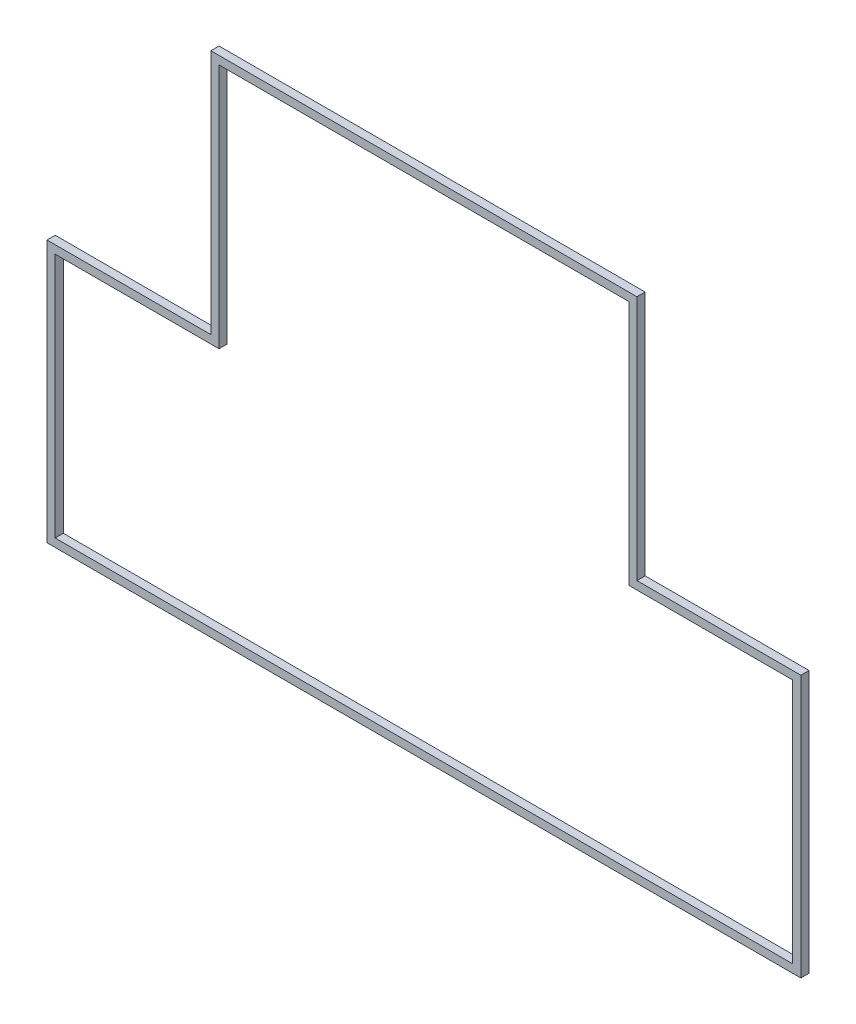
ISO-10303-21;
HEADER;
FILE_DESCRIPTION(('STEP AP214'),'2;1');
FILE_NAME('part.step','',(''),(''),'','','');
FILE_SCHEMA(('AUTOMOTIVE_DESIGN { 1 0 10303 214 1 1 1 1 }'));
ENDSEC;
DATA;
#1=APPLICATION_CONTEXT('core data for automotive mechanical design processes');
#2=APPLICATION_PROTOCOL_DEFINITION('international standard','automotive_design',2000,#1);
#3=PRODUCT_CONTEXT('',#1,'mechanical');
#4=PRODUCT('Part','Part','',(#3));
#5=PRODUCT_RELATED_PRODUCT_CATEGORY('part','',(#4));
#6=PRODUCT_DEFINITION_FORMATION('','',#4);
#7=PRODUCT_DEFINITION_CONTEXT('part definition',#1,'design');
#8=PRODUCT_DEFINITION('design','',#6,#7);
#9=PRODUCT_DEFINITION_SHAPE('','',#8);
#10=(LENGTH_UNIT() NAMED_UNIT(*) SI_UNIT(.MILLI.,.METRE.));
#11=(NAMED_UNIT(*) PLANE_ANGLE_UNIT() SI_UNIT($,.RADIAN.));
#12=(NAMED_UNIT(*) SI_UNIT($,.STERADIAN.) SOLID_ANGLE_UNIT());
#13=UNCERTAINTY_MEASURE_WITH_UNIT(LENGTH_MEASURE(1.E-05),#10,'distance_accuracy_value','');
#14=(GEOMETRIC_REPRESENTATION_CONTEXT(3) GLOBAL_UNCERTAINTY_ASSIGNED_CONTEXT((#13)) GLOBAL_UNIT_ASSIGNED_CONTEXT((#10,
#11,#12)) REPRESENTATION_CONTEXT('',''));
#15=CARTESIAN_POINT('',(0.,0.,0.));
#16=DIRECTION('',(0.,0.,1.));
#17=DIRECTION('',(1.,0.,0.));
#18=AXIS2_PLACEMENT_3D('',#15,#16,#17);
#19=CARTESIAN_POINT('',(143.917368028597,60.6995866341911,-39.1));
#20=DIRECTION('',(0.,0.,-1.));
#21=DIRECTION('',(-1.,0.,0.));
#22=AXIS2_PLACEMENT_3D('',#19,#20,#21);
#23=PLANE('',#22);
#24=DIRECTION('',(0.,1.,0.));
#25=VECTOR('',#24,1.);
#26=CARTESIAN_POINT('',(146.017368028597,63.5995866341911,-39.1));
#27=LINE('',#26,#25);
#28=CARTESIAN_POINT('',(146.017368028597,63.5995866341911,-39.1));
#29=VERTEX_POINT('',#28);
#30=CARTESIAN_POINT('',(146.017368028597,60.5995866341911,-39.1));
#31=VERTEX_POINT('',#30);
#32=EDGE_CURVE('E202',#29,#31,#27,.F.);
#33=ORIENTED_EDGE('',*,*,#32,.T.);
#34=DIRECTION('',(1.,0.,0.));
#35=VECTOR('',#34,1.);
#36=CARTESIAN_POINT('',(146.017368028597,60.5995866341911,-39.1));
#37=LINE('',#36,#35);
#38=CARTESIAN_POINT('',(144.017368028597,60.5995866341911,-39.1));
#39=VERTEX_POINT('',#38);
#40=EDGE_CURVE('E207',#31,#39,#37,.F.);
#41=ORIENTED_EDGE('',*,*,#40,.T.);
#42=DIRECTION('',(0.,1.,0.));
#43=VECTOR('',#42,1.);
#44=CARTESIAN_POINT('',(144.017368028597,60.5995866341911,-39.1));
#45=LINE('',#44,#43);
#46=CARTESIAN_POINT('',(144.017368028597,57.5995866341911,-39.1));
#47=VERTEX_POINT('',#46);
#48=EDGE_CURVE('E210',#39,#47,#45,.F.);
#49=ORIENTED_EDGE('',*,*,#48,.T.);
#50=DIRECTION('',(1.,0.,0.));
#51=VECTOR('',#50,1.);
#52=CARTESIAN_POINT('',(144.017368028597,57.5995866341911,-39.1));
#53=LINE('',#52,#51);
#54=CARTESIAN_POINT('',(153.017368028597,57.5995866341911,-39.1));
#55=VERTEX_POINT('',#54);
#56=EDGE_CURVE('E177',#47,#55,#53,.T.);
#57=ORIENTED_EDGE('',*,*,#56,.T.);
#58=DIRECTION('',(0.,1.,0.));
#59=VECTOR('',#58,1.);
#60=CARTESIAN_POINT('',(153.017368028597,57.5995866341911,-39.1));
#61=LINE('',#60,#59);
#62=CARTESIAN_POINT('',(153.017368028597,60.5995866341911,-39.1));
#63=VERTEX_POINT('',#62);
#64=EDGE_CURVE('E182',#55,#63,#61,.T.);
#65=ORIENTED_EDGE('',*,*,#64,.T.);
#66=DIRECTION('',(1.,0.,0.));
#67=VECTOR('',#66,1.);
#68=CARTESIAN_POINT('',(153.017368028597,60.5995866341911,-39.1));
#69=LINE('',#68,#67);
#70=CARTESIAN_POINT('',(151.017368028597,60.5995866341911,-39.1));
#71=VERTEX_POINT('',#70);
#72=EDGE_CURVE('E187',#63,#71,#69,.F.);
#73=ORIENTED_EDGE('',*,*,#72,.T.);
#74=DIRECTION('',(0.,1.,0.));
#75=VECTOR('',#74,1.);
#76=CARTESIAN_POINT('',(151.017368028597,60.5995866341911,-39.1));
#77=LINE('',#76,#75);
#78=CARTESIAN_POINT('',(151.017368028597,63.5995866341911,-39.1));
#79=VERTEX_POINT('',#78);
#80=EDGE_CURVE('E192',#71,#79,#77,.T.);
#81=ORIENTED_EDGE('',*,*,#80,.T.);
#82=DIRECTION('',(1.,0.,0.));
#83=VECTOR('',#82,1.);
#84=CARTESIAN_POINT('',(151.017368028597,63.5995866341911,-39.1));
#85=LINE('',#84,#83);
#86=EDGE_CURVE('E197',#79,#29,#85,.F.);
#87=ORIENTED_EDGE('',*,*,#86,.T.);
#88=EDGE_LOOP('',(#33,#41,#49,#57,#65,#73,#81,#87));
#89=FACE_BOUND('',#88,.T.);
#90=DIRECTION('',(0.,1.,0.));
#91=VECTOR('',#90,1.);
#92=CARTESIAN_POINT('',(153.117368028597,60.6995866341911,-39.1));
#93=LINE('',#92,#91);
#94=CARTESIAN_POINT('',(153.117368028597,60.6995866341911,-39.1));
#95=VERTEX_POINT('',#94);
#96=CARTESIAN_POINT('',(153.117368028597,57.4995866341911,-39.1));
#97=VERTEX_POINT('',#96);
#98=EDGE_CURVE('E164',#95,#97,#93,.F.);
#99=ORIENTED_EDGE('',*,*,#98,.T.);
#100=DIRECTION('',(1.,0.,0.));
#101=VECTOR('',#100,1.);
#102=CARTESIAN_POINT('',(153.117368028597,57.4995866341911,-39.1));
#103=LINE('',#102,#101);
#104=CARTESIAN_POINT('',(143.917368028597,57.4995866341911,-39.1));
#105=VERTEX_POINT('',#104);
#106=EDGE_CURVE('E169',#97,#105,#103,.F.);
#107=ORIENTED_EDGE('',*,*,#106,.T.);
#108=DIRECTION('',(0.,1.,0.));
#109=VECTOR('',#108,1.);
#110=CARTESIAN_POINT('',(143.917368028597,57.4995866341911,-39.1));
#111=LINE('',#110,#109);
#112=CARTESIAN_POINT('',(143.917368028597,60.6995866341911,-39.1));
#113=VERTEX_POINT('',#112);
#114=EDGE_CURVE('E131',#105,#113,#111,.T.);
#115=ORIENTED_EDGE('',*,*,#114,.T.);
#116=DIRECTION('',(1.,0.,0.));
#117=VECTOR('',#116,1.);
#118=CARTESIAN_POINT('',(143.917368028597,60.6995866341911,-39.1));
#119=LINE('',#118,#117);
#120=CARTESIAN_POINT('',(145.917368028597,60.6995866341911,-39.1));
#121=VERTEX_POINT('',#120);
#122=EDGE_CURVE('E20',#113,#121,#119,.T.);
#123=ORIENTED_EDGE('',*,*,#122,.T.);
#124=DIRECTION('',(0.,1.,0.));
#125=VECTOR('',#124,1.);
#126=CARTESIAN_POINT('',(145.917368028597,60.6995866341911,-39.1));
#127=LINE('',#126,#125);
#128=CARTESIAN_POINT('',(145.917368028597,63.6995866341911,-39.1));
#129=VERTEX_POINT('',#128);
#130=EDGE_CURVE('E127',#121,#129,#127,.T.);
#131=ORIENTED_EDGE('',*,*,#130,.T.);
#132=DIRECTION('',(1.,0.,0.));
#133=VECTOR('',#132,1.);
#134=CARTESIAN_POINT('',(145.917368028597,63.6995866341911,-39.1));
#135=LINE('',#134,#133);
#136=CARTESIAN_POINT('',(151.117368028597,63.6995866341911,-39.1));
#137=VERTEX_POINT('',#136);
#138=EDGE_CURVE('E149',#129,#137,#135,.T.);
#139=ORIENTED_EDGE('',*,*,#138,.T.);
#140=DIRECTION('',(0.,1.,0.));
#141=VECTOR('',#140,1.);
#142=CARTESIAN_POINT('',(151.117368028597,63.6995866341911,-39.1));
#143=LINE('',#142,#141);
#144=CARTESIAN_POINT('',(151.117368028597,60.6995866341911,-39.1));
#145=VERTEX_POINT('',#144);
#146=EDGE_CURVE('E154',#137,#145,#143,.F.);
#147=ORIENTED_EDGE('',*,*,#146,.T.);
#148=DIRECTION('',(1.,0.,0.));
#149=VECTOR('',#148,1.);
#150=CARTESIAN_POINT('',(151.117368028597,60.6995866341911,-39.1));
#151=LINE('',#150,#149);
#152=EDGE_CURVE('E159',#145,#95,#151,.T.);
#153=ORIENTED_EDGE('',*,*,#152,.T.);
#154=EDGE_LOOP('',(#99,#107,#115,#123,#131,#139,#147,#153));
#155=FACE_BOUND('',#154,.T.);
#156=ADVANCED_FACE('F17',(#89,#155),#23,.T.);
#157=CARTESIAN_POINT('',(143.917368028597,60.6995866341911,-39.1));
#158=DIRECTION('',(0.,-1.,0.));
#159=DIRECTION('',(0.,0.,-1.));
#160=AXIS2_PLACEMENT_3D('',#157,#158,#159);
#161=PLANE('',#160);
#162=DIRECTION('',(0.,0.,-1.));
#163=VECTOR('',#162,1.);
#164=CARTESIAN_POINT('',(145.917368028597,60.6995866341911,-39.1));
#165=LINE('',#164,#163);
#166=CARTESIAN_POINT('',(145.917368028597,60.6995866341911,-39.));
#167=VERTEX_POINT('',#166);
#168=EDGE_CURVE('E136',#167,#121,#165,.T.);
#169=ORIENTED_EDGE('',*,*,#168,.T.);
#170=ORIENTED_EDGE('',*,*,#122,.F.);
#171=DIRECTION('',(0.,0.,-1.));
#172=VECTOR('',#171,1.);
#173=CARTESIAN_POINT('',(143.917368028597,60.6995866341911,-39.1));
#174=LINE('',#173,#172);
#175=CARTESIAN_POINT('',(143.917368028597,60.6995866341911,-39.));
#176=VERTEX_POINT('',#175);
#177=EDGE_CURVE('E175',#113,#176,#174,.F.);
#178=ORIENTED_EDGE('',*,*,#177,.T.);
#179=DIRECTION('',(-1.,0.,0.));
#180=VECTOR('',#179,1.);
#181=CARTESIAN_POINT('',(143.917368028597,60.6995866341911,-39.));
#182=LINE('',#181,#180);
#183=EDGE_CURVE('E146',#176,#167,#182,.F.);
#184=ORIENTED_EDGE('',*,*,#183,.T.);
#185=EDGE_LOOP('',(#169,#170,#178,#184));
#186=FACE_BOUND('',#185,.T.);
#187=ADVANCED_FACE('F145',(#186),#161,.F.);
#188=CARTESIAN_POINT('',(145.917368028597,60.6995866341911,-39.1));
#189=DIRECTION('',(1.,0.,0.));
#190=DIRECTION('',(0.,0.,-1.));
#191=AXIS2_PLACEMENT_3D('',#188,#189,#190);
#192=PLANE('',#191);
#193=DIRECTION('',(0.,0.,-1.));
#194=VECTOR('',#193,1.);
#195=CARTESIAN_POINT('',(145.917368028597,63.6995866341911,-39.1));
#196=LINE('',#195,#194);
#197=CARTESIAN_POINT('',(145.917368028597,63.6995866341911,-39.));
#198=VERTEX_POINT('',#197);
#199=EDGE_CURVE('E142',#198,#129,#196,.T.);
#200=ORIENTED_EDGE('',*,*,#199,.T.);
#201=ORIENTED_EDGE('',*,*,#130,.F.);
#202=ORIENTED_EDGE('',*,*,#168,.F.);
#203=DIRECTION('',(0.,1.,0.));
#204=VECTOR('',#203,1.);
#205=CARTESIAN_POINT('',(145.917368028597,60.6995866341911,-39.));
#206=LINE('',#205,#204);
#207=EDGE_CURVE('E217',#167,#198,#206,.T.);
#208=ORIENTED_EDGE('',*,*,#207,.T.);
#209=EDGE_LOOP('',(#200,#201,#202,#208));
#210=FACE_BOUND('',#209,.T.);
#211=ADVANCED_FACE('F139',(#210),#192,.F.);
#212=CARTESIAN_POINT('',(145.917368028597,63.6995866341911,-39.1));
#213=DIRECTION('',(0.,-1.,0.));
#214=DIRECTION('',(0.,0.,-1.));
#215=AXIS2_PLACEMENT_3D('',#212,#213,#214);
#216=PLANE('',#215);
#217=DIRECTION('',(0.,0.,1.));
#218=VECTOR('',#217,1.);
#219=CARTESIAN_POINT('',(151.117368028597,63.6995866341911,-39.1));
#220=LINE('',#219,#218);
#221=CARTESIAN_POINT('',(151.117368028597,63.6995866341911,-39.));
#222=VERTEX_POINT('',#221);
#223=EDGE_CURVE('E151',#222,#137,#220,.F.);
#224=ORIENTED_EDGE('',*,*,#223,.T.);
#225=ORIENTED_EDGE('',*,*,#138,.F.);
#226=ORIENTED_EDGE('',*,*,#199,.F.);
#227=DIRECTION('',(-1.,0.,0.));
#228=VECTOR('',#227,1.);
#229=CARTESIAN_POINT('',(143.917368028597,63.6995866341911,-39.));
#230=LINE('',#229,#228);
#231=EDGE_CURVE('E219',#198,#222,#230,.F.);
#232=ORIENTED_EDGE('',*,*,#231,.T.);
#233=EDGE_LOOP('',(#224,#225,#226,#232));
#234=FACE_BOUND('',#233,.T.);
#235=ADVANCED_FACE('F328',(#234),#216,.F.);
#236=CARTESIAN_POINT('',(151.117368028597,63.6995866341911,-39.1));
#237=DIRECTION('',(-1.,0.,0.));
#238=DIRECTION('',(0.,0.,1.));
#239=AXIS2_PLACEMENT_3D('',#236,#237,#238);
#240=PLANE('',#239);
#241=DIRECTION('',(0.,0.,-1.));
#242=VECTOR('',#241,1.);
#243=CARTESIAN_POINT('',(151.117368028597,60.6995866341911,-39.1));
#244=LINE('',#243,#242);
#245=CARTESIAN_POINT('',(151.117368028597,60.6995866341911,-39.));
#246=VERTEX_POINT('',#245);
#247=EDGE_CURVE('E156',#246,#145,#244,.T.);
#248=ORIENTED_EDGE('',*,*,#247,.T.);
#249=ORIENTED_EDGE('',*,*,#146,.F.);
#250=ORIENTED_EDGE('',*,*,#223,.F.);
#251=DIRECTION('',(0.,1.,0.));
#252=VECTOR('',#251,1.);
#253=CARTESIAN_POINT('',(151.117368028597,60.6995866341911,-39.));
#254=LINE('',#253,#252);
#255=EDGE_CURVE('E222',#222,#246,#254,.F.);
#256=ORIENTED_EDGE('',*,*,#255,.T.);
#257=EDGE_LOOP('',(#248,#249,#250,#256));
#258=FACE_BOUND('',#257,.T.);
#259=ADVANCED_FACE('F324',(#258),#240,.F.);
#260=CARTESIAN_POINT('',(151.117368028597,60.6995866341911,-39.1));
#261=DIRECTION('',(0.,-1.,0.));
#262=DIRECTION('',(0.,0.,-1.));
#263=AXIS2_PLACEMENT_3D('',#260,#261,#262);
#264=PLANE('',#263);
#265=DIRECTION('',(0.,0.,1.));
#266=VECTOR('',#265,1.);
#267=CARTESIAN_POINT('',(153.117368028597,60.6995866341911,-39.1));
#268=LINE('',#267,#266);
#269=CARTESIAN_POINT('',(153.117368028597,60.6995866341911,-39.));
#270=VERTEX_POINT('',#269);
#271=EDGE_CURVE('E161',#270,#95,#268,.F.);
#272=ORIENTED_EDGE('',*,*,#271,.T.);
#273=ORIENTED_EDGE('',*,*,#152,.F.);
#274=ORIENTED_EDGE('',*,*,#247,.F.);
#275=DIRECTION('',(-1.,0.,0.));
#276=VECTOR('',#275,1.);
#277=CARTESIAN_POINT('',(143.917368028597,60.6995866341911,-39.));
#278=LINE('',#277,#276);
#279=EDGE_CURVE('E225',#246,#270,#278,.F.);
#280=ORIENTED_EDGE('',*,*,#279,.T.);
#281=EDGE_LOOP('',(#272,#273,#274,#280));
#282=FACE_BOUND('',#281,.T.);
#283=ADVANCED_FACE('F320',(#282),#264,.F.);
#284=CARTESIAN_POINT('',(153.117368028597,60.6995866341911,-39.1));
#285=DIRECTION('',(-1.,0.,0.));
#286=DIRECTION('',(0.,0.,1.));
#287=AXIS2_PLACEMENT_3D('',#284,#285,#286);
#288=PLANE('',#287);
#289=DIRECTION('',(0.,0.,1.));
#290=VECTOR('',#289,1.);
#291=CARTESIAN_POINT('',(153.117368028597,57.4995866341911,-39.1));
#292=LINE('',#291,#290);
#293=CARTESIAN_POINT('',(153.117368028597,57.4995866341911,-39.));
#294=VERTEX_POINT('',#293);
#295=EDGE_CURVE('E166',#294,#97,#292,.F.);
#296=ORIENTED_EDGE('',*,*,#295,.T.);
#297=ORIENTED_EDGE('',*,*,#98,.F.);
#298=ORIENTED_EDGE('',*,*,#271,.F.);
#299=DIRECTION('',(0.,1.,0.));
#300=VECTOR('',#299,1.);
#301=CARTESIAN_POINT('',(153.117368028597,60.6995866341911,-39.));
#302=LINE('',#301,#300);
#303=EDGE_CURVE('E228',#270,#294,#302,.F.);
#304=ORIENTED_EDGE('',*,*,#303,.T.);
#305=EDGE_LOOP('',(#296,#297,#298,#304));
#306=FACE_BOUND('',#305,.T.);
#307=ADVANCED_FACE('F316',(#306),#288,.F.);
#308=CARTESIAN_POINT('',(153.117368028597,57.4995866341911,-39.1));
#309=DIRECTION('',(0.,1.,0.));
#310=DIRECTION('',(0.,0.,1.));
#311=AXIS2_PLACEMENT_3D('',#308,#309,#310);
#312=PLANE('',#311);
#313=DIRECTION('',(0.,0.,-1.));
#314=VECTOR('',#313,1.);
#315=CARTESIAN_POINT('',(143.917368028597,57.4995866341911,-39.1));
#316=LINE('',#315,#314);
#317=CARTESIAN_POINT('',(143.917368028597,57.4995866341911,-39.));
#318=VERTEX_POINT('',#317);
#319=EDGE_CURVE('E171',#318,#105,#316,.T.);
#320=ORIENTED_EDGE('',*,*,#319,.T.);
#321=ORIENTED_EDGE('',*,*,#106,.F.);
#322=ORIENTED_EDGE('',*,*,#295,.F.);
#323=DIRECTION('',(-1.,0.,0.));
#324=VECTOR('',#323,1.);
#325=CARTESIAN_POINT('',(143.917368028597,57.4995866341911,-39.));
#326=LINE('',#325,#324);
#327=EDGE_CURVE('E231',#294,#318,#326,.T.);
#328=ORIENTED_EDGE('',*,*,#327,.T.);
#329=EDGE_LOOP('',(#320,#321,#322,#328));
#330=FACE_BOUND('',#329,.T.);
#331=ADVANCED_FACE('F312',(#330),#312,.F.);
#332=CARTESIAN_POINT('',(143.917368028597,57.4995866341911,-39.1));
#333=DIRECTION('',(1.,0.,0.));
#334=DIRECTION('',(0.,0.,-1.));
#335=AXIS2_PLACEMENT_3D('',#332,#333,#334);
#336=PLANE('',#335);
#337=ORIENTED_EDGE('',*,*,#177,.F.);
#338=ORIENTED_EDGE('',*,*,#114,.F.);
#339=ORIENTED_EDGE('',*,*,#319,.F.);
#340=DIRECTION('',(0.,1.,0.));
#341=VECTOR('',#340,1.);
#342=CARTESIAN_POINT('',(143.917368028597,60.6995866341911,-39.));
#343=LINE('',#342,#341);
#344=EDGE_CURVE('E234',#318,#176,#343,.T.);
#345=ORIENTED_EDGE('',*,*,#344,.T.);
#346=EDGE_LOOP('',(#337,#338,#339,#345));
#347=FACE_BOUND('',#346,.T.);
#348=ADVANCED_FACE('F309',(#347),#336,.F.);
#349=CARTESIAN_POINT('',(144.017368028597,57.5995866341911,-39.1));
#350=DIRECTION('',(0.,-1.,0.));
#351=DIRECTION('',(0.,0.,-1.));
#352=AXIS2_PLACEMENT_3D('',#349,#350,#351);
#353=PLANE('',#352);
#354=DIRECTION('',(0.,0.,-1.));
#355=VECTOR('',#354,1.);
#356=CARTESIAN_POINT('',(153.017368028597,57.5995866341911,-39.1));
#357=LINE('',#356,#355);
#358=CARTESIAN_POINT('',(153.017368028597,57.5995866341911,-39.));
#359=VERTEX_POINT('',#358);
#360=EDGE_CURVE('E179',#359,#55,#357,.T.);
#361=ORIENTED_EDGE('',*,*,#360,.T.);
#362=ORIENTED_EDGE('',*,*,#56,.F.);
#363=DIRECTION('',(0.,0.,1.));
#364=VECTOR('',#363,1.);
#365=CARTESIAN_POINT('',(144.017368028597,57.5995866341911,-39.1));
#366=LINE('',#365,#364);
#367=CARTESIAN_POINT('',(144.017368028597,57.5995866341911,-39.));
#368=VERTEX_POINT('',#367);
#369=EDGE_CURVE('E213',#47,#368,#366,.T.);
#370=ORIENTED_EDGE('',*,*,#369,.T.);
#371=DIRECTION('',(-1.,0.,0.));
#372=VECTOR('',#371,1.);
#373=CARTESIAN_POINT('',(143.917368028597,57.5995866341911,-39.));
#374=LINE('',#373,#372);
#375=EDGE_CURVE('E237',#368,#359,#374,.F.);
#376=ORIENTED_EDGE('',*,*,#375,.T.);
#377=EDGE_LOOP('',(#361,#362,#370,#376));
#378=FACE_BOUND('',#377,.T.);
#379=ADVANCED_FACE('F284',(#378),#353,.F.);
#380=CARTESIAN_POINT('',(153.017368028597,57.5995866341911,-39.1));
#381=DIRECTION('',(1.,0.,0.));
#382=DIRECTION('',(0.,0.,-1.));
#383=AXIS2_PLACEMENT_3D('',#380,#381,#382);
#384=PLANE('',#383);
#385=DIRECTION('',(0.,0.,1.));
#386=VECTOR('',#385,1.);
#387=CARTESIAN_POINT('',(153.017368028597,60.5995866341911,-39.1));
#388=LINE('',#387,#386);
#389=CARTESIAN_POINT('',(153.017368028597,60.5995866341911,-39.));
#390=VERTEX_POINT('',#389);
#391=EDGE_CURVE('E184',#390,#63,#388,.F.);
#392=ORIENTED_EDGE('',*,*,#391,.T.);
#393=ORIENTED_EDGE('',*,*,#64,.F.);
#394=ORIENTED_EDGE('',*,*,#360,.F.);
#395=DIRECTION('',(0.,1.,0.));
#396=VECTOR('',#395,1.);
#397=CARTESIAN_POINT('',(153.017368028597,60.6995866341911,-39.));
#398=LINE('',#397,#396);
#399=EDGE_CURVE('E240',#359,#390,#398,.T.);
#400=ORIENTED_EDGE('',*,*,#399,.T.);
#401=EDGE_LOOP('',(#392,#393,#394,#400));
#402=FACE_BOUND('',#401,.T.);
#403=ADVANCED_FACE('F281',(#402),#384,.F.);
#404=CARTESIAN_POINT('',(153.017368028597,60.5995866341911,-39.1));
#405=DIRECTION('',(0.,1.,0.));
#406=DIRECTION('',(0.,0.,1.));
#407=AXIS2_PLACEMENT_3D('',#404,#405,#406);
#408=PLANE('',#407);
#409=DIRECTION('',(0.,0.,-1.));
#410=VECTOR('',#409,1.);
#411=CARTESIAN_POINT('',(151.017368028597,60.5995866341911,-39.1));
#412=LINE('',#411,#410);
#413=CARTESIAN_POINT('',(151.017368028597,60.5995866341911,-39.));
#414=VERTEX_POINT('',#413);
#415=EDGE_CURVE('E189',#414,#71,#412,.T.);
#416=ORIENTED_EDGE('',*,*,#415,.T.);
#417=ORIENTED_EDGE('',*,*,#72,.F.);
#418=ORIENTED_EDGE('',*,*,#391,.F.);
#419=DIRECTION('',(-1.,0.,0.));
#420=VECTOR('',#419,1.);
#421=CARTESIAN_POINT('',(143.917368028597,60.5995866341911,-39.));
#422=LINE('',#421,#420);
#423=EDGE_CURVE('E243',#390,#414,#422,.T.);
#424=ORIENTED_EDGE('',*,*,#423,.T.);
#425=EDGE_LOOP('',(#416,#417,#418,#424));
#426=FACE_BOUND('',#425,.T.);
#427=ADVANCED_FACE('F278',(#426),#408,.F.);
#428=CARTESIAN_POINT('',(151.017368028597,60.5995866341911,-39.1));
#429=DIRECTION('',(1.,0.,0.));
#430=DIRECTION('',(0.,0.,-1.));
#431=AXIS2_PLACEMENT_3D('',#428,#429,#430);
#432=PLANE('',#431);
#433=DIRECTION('',(0.,0.,1.));
#434=VECTOR('',#433,1.);
#435=CARTESIAN_POINT('',(151.017368028597,63.5995866341911,-39.1));
#436=LINE('',#435,#434);
#437=CARTESIAN_POINT('',(151.017368028597,63.5995866341911,-39.));
#438=VERTEX_POINT('',#437);
#439=EDGE_CURVE('E194',#438,#79,#436,.F.);
#440=ORIENTED_EDGE('',*,*,#439,.T.);
#441=ORIENTED_EDGE('',*,*,#80,.F.);
#442=ORIENTED_EDGE('',*,*,#415,.F.);
#443=DIRECTION('',(0.,1.,0.));
#444=VECTOR('',#443,1.);
#445=CARTESIAN_POINT('',(151.017368028597,60.6995866341911,-39.));
#446=LINE('',#445,#444);
#447=EDGE_CURVE('E246',#414,#438,#446,.T.);
#448=ORIENTED_EDGE('',*,*,#447,.T.);
#449=EDGE_LOOP('',(#440,#441,#442,#448));
#450=FACE_BOUND('',#449,.T.);
#451=ADVANCED_FACE('F274',(#450),#432,.F.);
#452=CARTESIAN_POINT('',(151.017368028597,63.5995866341911,-39.1));
#453=DIRECTION('',(0.,1.,0.));
#454=DIRECTION('',(0.,0.,1.));
#455=AXIS2_PLACEMENT_3D('',#452,#453,#454);
#456=PLANE('',#455);
#457=DIRECTION('',(0.,0.,1.));
#458=VECTOR('',#457,1.);
#459=CARTESIAN_POINT('',(146.017368028597,63.5995866341911,-39.1));
#460=LINE('',#459,#458);
#461=CARTESIAN_POINT('',(146.017368028597,63.5995866341911,-39.));
#462=VERTEX_POINT('',#461);
#463=EDGE_CURVE('E199',#462,#29,#460,.F.);
#464=ORIENTED_EDGE('',*,*,#463,.T.);
#465=ORIENTED_EDGE('',*,*,#86,.F.);
#466=ORIENTED_EDGE('',*,*,#439,.F.);
#467=DIRECTION('',(-1.,0.,0.));
#468=VECTOR('',#467,1.);
#469=CARTESIAN_POINT('',(143.917368028597,63.5995866341911,-39.));
#470=LINE('',#469,#468);
#471=EDGE_CURVE('E249',#438,#462,#470,.T.);
#472=ORIENTED_EDGE('',*,*,#471,.T.);
#473=EDGE_LOOP('',(#464,#465,#466,#472));
#474=FACE_BOUND('',#473,.T.);
#475=ADVANCED_FACE('F270',(#474),#456,.F.);
#476=CARTESIAN_POINT('',(146.017368028597,63.5995866341911,-39.1));
#477=DIRECTION('',(-1.,0.,0.));
#478=DIRECTION('',(0.,0.,1.));
#479=AXIS2_PLACEMENT_3D('',#476,#477,#478);
#480=PLANE('',#479);
#481=DIRECTION('',(0.,0.,1.));
#482=VECTOR('',#481,1.);
#483=CARTESIAN_POINT('',(146.017368028597,60.5995866341911,-39.1));
#484=LINE('',#483,#482);
#485=CARTESIAN_POINT('',(146.017368028597,60.5995866341911,-39.));
#486=VERTEX_POINT('',#485);
#487=EDGE_CURVE('E204',#486,#31,#484,.F.);
#488=ORIENTED_EDGE('',*,*,#487,.T.);
#489=ORIENTED_EDGE('',*,*,#32,.F.);
#490=ORIENTED_EDGE('',*,*,#463,.F.);
#491=DIRECTION('',(0.,1.,0.));
#492=VECTOR('',#491,1.);
#493=CARTESIAN_POINT('',(146.017368028597,60.6995866341911,-39.));
#494=LINE('',#493,#492);
#495=EDGE_CURVE('E252',#462,#486,#494,.F.);
#496=ORIENTED_EDGE('',*,*,#495,.T.);
#497=EDGE_LOOP('',(#488,#489,#490,#496));
#498=FACE_BOUND('',#497,.T.);
#499=ADVANCED_FACE('F266',(#498),#480,.F.);
#500=CARTESIAN_POINT('',(146.017368028597,60.5995866341911,-39.1));
#501=DIRECTION('',(0.,1.,0.));
#502=DIRECTION('',(0.,0.,1.));
#503=AXIS2_PLACEMENT_3D('',#500,#501,#502);
#504=PLANE('',#503);
#505=DIRECTION('',(0.,0.,1.));
#506=VECTOR('',#505,1.);
#507=CARTESIAN_POINT('',(144.017368028597,60.5995866341911,-39.1));
#508=LINE('',#507,#506);
#509=CARTESIAN_POINT('',(144.017368028597,60.5995866341911,-39.));
#510=VERTEX_POINT('',#509);
#511=EDGE_CURVE('E34',#510,#39,#508,.F.);
#512=ORIENTED_EDGE('',*,*,#511,.T.);
#513=ORIENTED_EDGE('',*,*,#40,.F.);
#514=ORIENTED_EDGE('',*,*,#487,.F.);
#515=DIRECTION('',(-1.,0.,0.));
#516=VECTOR('',#515,1.);
#517=CARTESIAN_POINT('',(143.917368028597,60.5995866341911,-39.));
#518=LINE('',#517,#516);
#519=EDGE_CURVE('E26',#486,#510,#518,.T.);
#520=ORIENTED_EDGE('',*,*,#519,.T.);
#521=EDGE_LOOP('',(#512,#513,#514,#520));
#522=FACE_BOUND('',#521,.T.);
#523=ADVANCED_FACE('F258',(#522),#504,.F.);
#524=CARTESIAN_POINT('',(144.017368028597,60.5995866341911,-39.1));
#525=DIRECTION('',(-1.,0.,0.));
#526=DIRECTION('',(0.,0.,1.));
#527=AXIS2_PLACEMENT_3D('',#524,#525,#526);
#528=PLANE('',#527);
#529=ORIENTED_EDGE('',*,*,#369,.F.);
#530=ORIENTED_EDGE('',*,*,#48,.F.);
#531=ORIENTED_EDGE('',*,*,#511,.F.);
#532=DIRECTION('',(0.,1.,0.));
#533=VECTOR('',#532,1.);
#534=CARTESIAN_POINT('',(144.017368028597,60.6995866341911,-39.));
#535=LINE('',#534,#533);
#536=EDGE_CURVE('E11',#510,#368,#535,.F.);
#537=ORIENTED_EDGE('',*,*,#536,.T.);
#538=EDGE_LOOP('',(#529,#530,#531,#537));
#539=FACE_BOUND('',#538,.T.);
#540=ADVANCED_FACE('F286',(#539),#528,.F.);
#541=CARTESIAN_POINT('',(143.917368028597,60.6995866341911,-39.));
#542=DIRECTION('',(0.,0.,-1.));
#543=DIRECTION('',(-1.,0.,0.));
#544=AXIS2_PLACEMENT_3D('',#541,#542,#543);
#545=PLANE('',#544);
#546=ORIENTED_EDGE('',*,*,#519,.F.);
#547=ORIENTED_EDGE('',*,*,#495,.F.);
#548=ORIENTED_EDGE('',*,*,#471,.F.);
#549=ORIENTED_EDGE('',*,*,#447,.F.);
#550=ORIENTED_EDGE('',*,*,#423,.F.);
#551=ORIENTED_EDGE('',*,*,#399,.F.);
#552=ORIENTED_EDGE('',*,*,#375,.F.);
#553=ORIENTED_EDGE('',*,*,#536,.F.);
#554=EDGE_LOOP('',(#546,#547,#548,#549,#550,#551,#552,#553));
#555=FACE_BOUND('',#554,.T.);
#556=ORIENTED_EDGE('',*,*,#327,.F.);
#557=ORIENTED_EDGE('',*,*,#303,.F.);
#558=ORIENTED_EDGE('',*,*,#279,.F.);
#559=ORIENTED_EDGE('',*,*,#255,.F.);
#560=ORIENTED_EDGE('',*,*,#231,.F.);
#561=ORIENTED_EDGE('',*,*,#207,.F.);
#562=ORIENTED_EDGE('',*,*,#183,.F.);
#563=ORIENTED_EDGE('',*,*,#344,.F.);
#564=EDGE_LOOP('',(#556,#557,#558,#559,#560,#561,#562,#563));
#565=FACE_BOUND('',#564,.T.);
#566=ADVANCED_FACE('F262',(#555,#565),#545,.F.);
#567=CLOSED_SHELL('',(#156,#187,#211,#235,#259,#283,#307,#331,#348,#379,#403,#427,#451,#475,
#499,#523,#540,#566));
#568=MANIFOLD_SOLID_BREP('B1',#567);
#569=ADVANCED_BREP_SHAPE_REPRESENTATION('',(#18,#568),#14);
#570=SHAPE_DEFINITION_REPRESENTATION(#9,#569);
ENDSEC;
END-ISO-10303-21;
